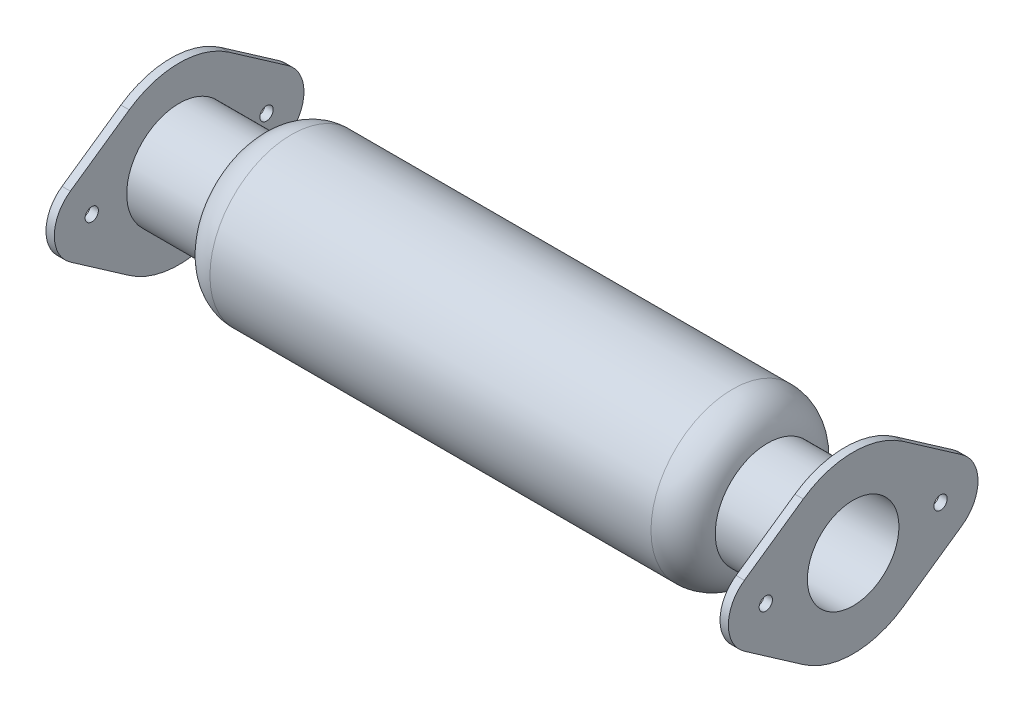
ISO-10303-21;
HEADER;
FILE_DESCRIPTION(('STEP AP214'),'2;1');
FILE_NAME('part.step','',(''),(''),'','','');
FILE_SCHEMA(('AUTOMOTIVE_DESIGN { 1 0 10303 214 1 1 1 1 }'));
ENDSEC;
DATA;
#1=APPLICATION_CONTEXT('core data for automotive mechanical design processes');
#2=APPLICATION_PROTOCOL_DEFINITION('international standard','automotive_design',2000,#1);
#3=PRODUCT_CONTEXT('',#1,'mechanical');
#4=PRODUCT('Part','Part','',(#3));
#5=PRODUCT_RELATED_PRODUCT_CATEGORY('part','',(#4));
#6=PRODUCT_DEFINITION_FORMATION('','',#4);
#7=PRODUCT_DEFINITION_CONTEXT('part definition',#1,'design');
#8=PRODUCT_DEFINITION('design','',#6,#7);
#9=PRODUCT_DEFINITION_SHAPE('','',#8);
#10=(LENGTH_UNIT() NAMED_UNIT(*) SI_UNIT(.MILLI.,.METRE.));
#11=(NAMED_UNIT(*) PLANE_ANGLE_UNIT() SI_UNIT($,.RADIAN.));
#12=(NAMED_UNIT(*) SI_UNIT($,.STERADIAN.) SOLID_ANGLE_UNIT());
#13=UNCERTAINTY_MEASURE_WITH_UNIT(LENGTH_MEASURE(1.E-05),#10,'distance_accuracy_value','');
#14=(GEOMETRIC_REPRESENTATION_CONTEXT(3) GLOBAL_UNCERTAINTY_ASSIGNED_CONTEXT((#13)) GLOBAL_UNIT_ASSIGNED_CONTEXT((#10,
#11,#12)) REPRESENTATION_CONTEXT('',''));
#15=CARTESIAN_POINT('',(0.,0.,0.));
#16=DIRECTION('',(0.,0.,1.));
#17=DIRECTION('',(1.,0.,0.));
#18=AXIS2_PLACEMENT_3D('',#15,#16,#17);
#19=CARTESIAN_POINT('',(0.,0.,0.));
#20=DIRECTION('',(1.,0.,0.));
#21=DIRECTION('',(0.,0.,-1.));
#22=AXIS2_PLACEMENT_3D('',#19,#20,#21);
#23=CYLINDRICAL_SURFACE('',#22,31.5);
#24=CARTESIAN_POINT('',(-200.,0.,0.));
#25=DIRECTION('',(1.,0.,0.));
#26=DIRECTION('',(0.,0.,-1.));
#27=AXIS2_PLACEMENT_3D('',#24,#25,#26);
#28=CIRCLE('',#27,31.5);
#29=CARTESIAN_POINT('',(-200.,0.,-31.5));
#30=VERTEX_POINT('',#29);
#31=EDGE_CURVE('E38',#30,#30,#28,.T.);
#32=ORIENTED_EDGE('',*,*,#31,.T.);
#33=EDGE_LOOP('',(#32));
#34=FACE_BOUND('',#33,.T.);
#35=CARTESIAN_POINT('',(-153.624630174278,0.,0.));
#36=DIRECTION('',(1.,0.,0.));
#37=DIRECTION('',(0.,0.,-1.));
#38=AXIS2_PLACEMENT_3D('',#35,#36,#37);
#39=CIRCLE('',#38,31.5);
#40=CARTESIAN_POINT('',(-153.624630174278,0.,-31.5));
#41=VERTEX_POINT('',#40);
#42=EDGE_CURVE('E11',#41,#41,#39,.T.);
#43=ORIENTED_EDGE('',*,*,#42,.F.);
#44=EDGE_LOOP('',(#43));
#45=FACE_BOUND('',#44,.T.);
#46=ADVANCED_FACE('F35',(#34,#45),#23,.T.);
#47=CARTESIAN_POINT('',(-132.5,0.,0.));
#48=DIRECTION('',(1.,0.,0.));
#49=DIRECTION('',(0.,0.,-1.));
#50=AXIS2_PLACEMENT_3D('',#47,#48,#49);
#51=TOROIDAL_SURFACE('',#50,27.5,21.5);
#52=ORIENTED_EDGE('',*,*,#42,.T.);
#53=EDGE_LOOP('',(#52));
#54=FACE_BOUND('',#53,.T.);
#55=CARTESIAN_POINT('',(-132.5,0.,0.));
#56=DIRECTION('',(1.,0.,0.));
#57=DIRECTION('',(0.,0.,-1.));
#58=AXIS2_PLACEMENT_3D('',#55,#56,#57);
#59=CIRCLE('',#58,49.);
#60=CARTESIAN_POINT('',(-132.5,0.,-49.));
#61=VERTEX_POINT('',#60);
#62=EDGE_CURVE('E44',#61,#61,#59,.T.);
#63=ORIENTED_EDGE('',*,*,#62,.F.);
#64=EDGE_LOOP('',(#63));
#65=FACE_BOUND('',#64,.T.);
#66=ADVANCED_FACE('F195',(#54,#65),#51,.T.);
#67=CARTESIAN_POINT('',(0.,0.,0.));
#68=DIRECTION('',(1.,0.,0.));
#69=DIRECTION('',(0.,0.,-1.));
#70=AXIS2_PLACEMENT_3D('',#67,#68,#69);
#71=CYLINDRICAL_SURFACE('',#70,49.);
#72=ORIENTED_EDGE('',*,*,#62,.T.);
#73=EDGE_LOOP('',(#72));
#74=FACE_BOUND('',#73,.T.);
#75=CARTESIAN_POINT('',(132.5,0.,0.));
#76=DIRECTION('',(1.,0.,0.));
#77=DIRECTION('',(0.,0.,-1.));
#78=AXIS2_PLACEMENT_3D('',#75,#76,#77);
#79=CIRCLE('',#78,49.);
#80=CARTESIAN_POINT('',(132.5,0.,-49.));
#81=VERTEX_POINT('',#80);
#82=EDGE_CURVE('E186',#81,#81,#79,.T.);
#83=ORIENTED_EDGE('',*,*,#82,.F.);
#84=EDGE_LOOP('',(#83));
#85=FACE_BOUND('',#84,.T.);
#86=ADVANCED_FACE('F192',(#74,#85),#71,.T.);
#87=CARTESIAN_POINT('',(132.5,0.,0.));
#88=DIRECTION('',(1.,0.,0.));
#89=DIRECTION('',(0.,0.,-1.));
#90=AXIS2_PLACEMENT_3D('',#87,#88,#89);
#91=TOROIDAL_SURFACE('',#90,27.5,21.5);
#92=ORIENTED_EDGE('',*,*,#82,.T.);
#93=EDGE_LOOP('',(#92));
#94=FACE_BOUND('',#93,.T.);
#95=CARTESIAN_POINT('',(153.624630174278,0.,0.));
#96=DIRECTION('',(1.,0.,0.));
#97=DIRECTION('',(0.,0.,-1.));
#98=AXIS2_PLACEMENT_3D('',#95,#96,#97);
#99=CIRCLE('',#98,31.5);
#100=CARTESIAN_POINT('',(153.624630174278,0.,-31.5));
#101=VERTEX_POINT('',#100);
#102=EDGE_CURVE('E183',#101,#101,#99,.T.);
#103=ORIENTED_EDGE('',*,*,#102,.F.);
#104=EDGE_LOOP('',(#103));
#105=FACE_BOUND('',#104,.T.);
#106=ADVANCED_FACE('F202',(#94,#105),#91,.T.);
#107=CARTESIAN_POINT('',(0.,0.,0.));
#108=DIRECTION('',(1.,0.,0.));
#109=DIRECTION('',(0.,0.,-1.));
#110=AXIS2_PLACEMENT_3D('',#107,#108,#109);
#111=CYLINDRICAL_SURFACE('',#110,31.5);
#112=ORIENTED_EDGE('',*,*,#102,.T.);
#113=EDGE_LOOP('',(#112));
#114=FACE_BOUND('',#113,.T.);
#115=CARTESIAN_POINT('',(200.,0.,0.));
#116=DIRECTION('',(1.,0.,0.));
#117=DIRECTION('',(0.,0.,-1.));
#118=AXIS2_PLACEMENT_3D('',#115,#116,#117);
#119=CIRCLE('',#118,31.5);
#120=CARTESIAN_POINT('',(200.,0.,-31.5));
#121=VERTEX_POINT('',#120);
#122=EDGE_CURVE('E180',#121,#121,#119,.T.);
#123=ORIENTED_EDGE('',*,*,#122,.F.);
#124=EDGE_LOOP('',(#123));
#125=FACE_BOUND('',#124,.T.);
#126=ADVANCED_FACE('F208',(#114,#125),#111,.T.);
#127=CARTESIAN_POINT('',(0.,0.,0.));
#128=DIRECTION('',(1.,0.,0.));
#129=DIRECTION('',(0.,0.,-1.));
#130=AXIS2_PLACEMENT_3D('',#127,#128,#129);
#131=CYLINDRICAL_SURFACE('',#130,27.5);
#132=CARTESIAN_POINT('',(150.,0.,0.));
#133=DIRECTION('',(1.,0.,0.));
#134=DIRECTION('',(0.,0.,-1.));
#135=AXIS2_PLACEMENT_3D('',#132,#133,#134);
#136=CIRCLE('',#135,27.5);
#137=CARTESIAN_POINT('',(150.,0.,-27.5));
#138=VERTEX_POINT('',#137);
#139=EDGE_CURVE('E177',#138,#138,#136,.T.);
#140=ORIENTED_EDGE('',*,*,#139,.F.);
#141=EDGE_LOOP('',(#140));
#142=FACE_BOUND('',#141,.T.);
#143=CARTESIAN_POINT('',(205.,0.,0.));
#144=DIRECTION('',(-1.,0.,0.));
#145=DIRECTION('',(0.,0.,1.));
#146=AXIS2_PLACEMENT_3D('',#143,#144,#145);
#147=CIRCLE('',#146,27.5);
#148=CARTESIAN_POINT('',(205.,0.,27.5));
#149=VERTEX_POINT('',#148);
#150=EDGE_CURVE('E331',#149,#149,#147,.T.);
#151=ORIENTED_EDGE('',*,*,#150,.F.);
#152=EDGE_LOOP('',(#151));
#153=FACE_BOUND('',#152,.T.);
#154=ADVANCED_FACE('F212',(#142,#153),#131,.F.);
#155=CARTESIAN_POINT('',(132.5,0.,0.));
#156=DIRECTION('',(1.,0.,0.));
#157=DIRECTION('',(0.,0.,-1.));
#158=AXIS2_PLACEMENT_3D('',#155,#156,#157);
#159=TOROIDAL_SURFACE('',#158,27.5,17.5);
#160=ORIENTED_EDGE('',*,*,#139,.T.);
#161=EDGE_LOOP('',(#160));
#162=FACE_BOUND('',#161,.T.);
#163=CARTESIAN_POINT('',(132.5,0.,0.));
#164=DIRECTION('',(1.,0.,0.));
#165=DIRECTION('',(0.,0.,-1.));
#166=AXIS2_PLACEMENT_3D('',#163,#164,#165);
#167=CIRCLE('',#166,45.);
#168=CARTESIAN_POINT('',(132.5,0.,-45.));
#169=VERTEX_POINT('',#168);
#170=EDGE_CURVE('E174',#169,#169,#167,.T.);
#171=ORIENTED_EDGE('',*,*,#170,.F.);
#172=EDGE_LOOP('',(#171));
#173=FACE_BOUND('',#172,.T.);
#174=ADVANCED_FACE('F216',(#162,#173),#159,.F.);
#175=CARTESIAN_POINT('',(0.,0.,0.));
#176=DIRECTION('',(1.,0.,0.));
#177=DIRECTION('',(0.,0.,-1.));
#178=AXIS2_PLACEMENT_3D('',#175,#176,#177);
#179=CYLINDRICAL_SURFACE('',#178,45.);
#180=ORIENTED_EDGE('',*,*,#170,.T.);
#181=EDGE_LOOP('',(#180));
#182=FACE_BOUND('',#181,.T.);
#183=CARTESIAN_POINT('',(-132.5,0.,0.));
#184=DIRECTION('',(1.,0.,0.));
#185=DIRECTION('',(0.,0.,-1.));
#186=AXIS2_PLACEMENT_3D('',#183,#184,#185);
#187=CIRCLE('',#186,45.);
#188=CARTESIAN_POINT('',(-132.5,0.,-45.));
#189=VERTEX_POINT('',#188);
#190=EDGE_CURVE('E171',#189,#189,#187,.T.);
#191=ORIENTED_EDGE('',*,*,#190,.F.);
#192=EDGE_LOOP('',(#191));
#193=FACE_BOUND('',#192,.T.);
#194=ADVANCED_FACE('F220',(#182,#193),#179,.F.);
#195=CARTESIAN_POINT('',(-132.5,0.,0.));
#196=DIRECTION('',(1.,0.,0.));
#197=DIRECTION('',(0.,0.,-1.));
#198=AXIS2_PLACEMENT_3D('',#195,#196,#197);
#199=TOROIDAL_SURFACE('',#198,27.5,17.5);
#200=ORIENTED_EDGE('',*,*,#190,.T.);
#201=EDGE_LOOP('',(#200));
#202=FACE_BOUND('',#201,.T.);
#203=CARTESIAN_POINT('',(-150.,0.,0.));
#204=DIRECTION('',(1.,0.,0.));
#205=DIRECTION('',(0.,0.,-1.));
#206=AXIS2_PLACEMENT_3D('',#203,#204,#205);
#207=CIRCLE('',#206,27.5);
#208=CARTESIAN_POINT('',(-150.,0.,-27.5));
#209=VERTEX_POINT('',#208);
#210=EDGE_CURVE('E168',#209,#209,#207,.T.);
#211=ORIENTED_EDGE('',*,*,#210,.F.);
#212=EDGE_LOOP('',(#211));
#213=FACE_BOUND('',#212,.T.);
#214=ADVANCED_FACE('F224',(#202,#213),#199,.F.);
#215=CARTESIAN_POINT('',(0.,0.,0.));
#216=DIRECTION('',(1.,0.,0.));
#217=DIRECTION('',(0.,0.,-1.));
#218=AXIS2_PLACEMENT_3D('',#215,#216,#217);
#219=CYLINDRICAL_SURFACE('',#218,27.5);
#220=ORIENTED_EDGE('',*,*,#210,.T.);
#221=EDGE_LOOP('',(#220));
#222=FACE_BOUND('',#221,.T.);
#223=CARTESIAN_POINT('',(-205.,0.,0.));
#224=DIRECTION('',(-1.,0.,0.));
#225=DIRECTION('',(0.,0.,1.));
#226=AXIS2_PLACEMENT_3D('',#223,#224,#225);
#227=CIRCLE('',#226,27.5);
#228=CARTESIAN_POINT('',(-205.,0.,27.5));
#229=VERTEX_POINT('',#228);
#230=EDGE_CURVE('E415',#229,#229,#227,.T.);
#231=ORIENTED_EDGE('',*,*,#230,.T.);
#232=EDGE_LOOP('',(#231));
#233=FACE_BOUND('',#232,.T.);
#234=ADVANCED_FACE('F228',(#222,#233),#219,.F.);
#235=CARTESIAN_POINT('',(-205.,0.,0.));
#236=DIRECTION('',(-1.,0.,0.));
#237=DIRECTION('',(0.,0.,1.));
#238=AXIS2_PLACEMENT_3D('',#235,#236,#237);
#239=PLANE('',#238);
#240=CARTESIAN_POINT('',(-205.,0.,52.5));
#241=DIRECTION('',(-1.,0.,0.));
#242=DIRECTION('',(0.,0.,1.));
#243=AXIS2_PLACEMENT_3D('',#240,#241,#242);
#244=CIRCLE('',#243,4.);
#245=CARTESIAN_POINT('',(-205.,0.,56.5));
#246=VERTEX_POINT('',#245);
#247=EDGE_CURVE('E419',#246,#246,#244,.T.);
#248=ORIENTED_EDGE('',*,*,#247,.F.);
#249=EDGE_LOOP('',(#248));
#250=FACE_BOUND('',#249,.T.);
#251=CARTESIAN_POINT('',(-205.,0.,0.));
#252=DIRECTION('',(-1.,0.,0.));
#253=DIRECTION('',(0.,0.,1.));
#254=AXIS2_PLACEMENT_3D('',#251,#252,#253);
#255=CIRCLE('',#254,52.5);
#256=CARTESIAN_POINT('',(-205.,43.0842198490352,30.));
#257=VERTEX_POINT('',#256);
#258=CARTESIAN_POINT('',(-205.,43.0842198490352,-30.));
#259=VERTEX_POINT('',#258);
#260=EDGE_CURVE('E153',#257,#259,#255,.T.);
#261=ORIENTED_EDGE('',*,*,#260,.T.);
#262=DIRECTION('',(0.,-0.571428571428571,-0.82065180664829));
#263=VECTOR('',#262,1.);
#264=CARTESIAN_POINT('',(-205.,43.0842198490352,-30.));
#265=LINE('',#264,#263);
#266=CARTESIAN_POINT('',(-205.,18.4646656495865,-65.3571428571428));
#267=VERTEX_POINT('',#266);
#268=EDGE_CURVE('E97',#259,#267,#265,.T.);
#269=ORIENTED_EDGE('',*,*,#268,.T.);
#270=CARTESIAN_POINT('',(-205.,0.,-52.5));
#271=DIRECTION('',(-1.,0.,0.));
#272=DIRECTION('',(0.,0.,1.));
#273=AXIS2_PLACEMENT_3D('',#270,#271,#272);
#274=CIRCLE('',#273,22.5);
#275=CARTESIAN_POINT('',(-205.,-18.4646656495865,-65.3571428571428));
#276=VERTEX_POINT('',#275);
#277=EDGE_CURVE('E431',#267,#276,#274,.T.);
#278=ORIENTED_EDGE('',*,*,#277,.T.);
#279=DIRECTION('',(0.,-0.571428571428572,0.82065180664829));
#280=VECTOR('',#279,1.);
#281=CARTESIAN_POINT('',(-205.,-18.4646656495865,-65.3571428571428));
#282=LINE('',#281,#280);
#283=CARTESIAN_POINT('',(-205.,-43.0842198490352,-30.));
#284=VERTEX_POINT('',#283);
#285=EDGE_CURVE('E433',#276,#284,#282,.T.);
#286=ORIENTED_EDGE('',*,*,#285,.T.);
#287=CARTESIAN_POINT('',(-205.,0.,0.));
#288=DIRECTION('',(-1.,0.,0.));
#289=DIRECTION('',(0.,0.,1.));
#290=AXIS2_PLACEMENT_3D('',#287,#288,#289);
#291=CIRCLE('',#290,52.5);
#292=CARTESIAN_POINT('',(-205.,-43.0842198490352,30.));
#293=VERTEX_POINT('',#292);
#294=EDGE_CURVE('E120',#284,#293,#291,.T.);
#295=ORIENTED_EDGE('',*,*,#294,.T.);
#296=DIRECTION('',(0.,0.571428571428571,0.82065180664829));
#297=VECTOR('',#296,1.);
#298=CARTESIAN_POINT('',(-205.,-18.4646656495865,65.3571428571429));
#299=LINE('',#298,#297);
#300=CARTESIAN_POINT('',(-205.,-18.4646656495865,65.3571428571429));
#301=VERTEX_POINT('',#300);
#302=EDGE_CURVE('E113',#293,#301,#299,.T.);
#303=ORIENTED_EDGE('',*,*,#302,.T.);
#304=CARTESIAN_POINT('',(-205.,0.,52.5));
#305=DIRECTION('',(-1.,0.,0.));
#306=DIRECTION('',(0.,0.,1.));
#307=AXIS2_PLACEMENT_3D('',#304,#305,#306);
#308=CIRCLE('',#307,22.5);
#309=CARTESIAN_POINT('',(-205.,18.4646656495865,65.3571428571428));
#310=VERTEX_POINT('',#309);
#311=EDGE_CURVE('E118',#301,#310,#308,.T.);
#312=ORIENTED_EDGE('',*,*,#311,.T.);
#313=DIRECTION('',(0.,0.571428571428571,-0.82065180664829));
#314=VECTOR('',#313,1.);
#315=CARTESIAN_POINT('',(-205.,18.4646656495865,65.3571428571428));
#316=LINE('',#315,#314);
#317=EDGE_CURVE('E52',#310,#257,#316,.T.);
#318=ORIENTED_EDGE('',*,*,#317,.T.);
#319=EDGE_LOOP('',(#261,#269,#278,#286,#295,#303,#312,#318));
#320=FACE_BOUND('',#319,.T.);
#321=CARTESIAN_POINT('',(-205.,0.,-52.5));
#322=DIRECTION('',(-1.,0.,0.));
#323=DIRECTION('',(0.,0.,1.));
#324=AXIS2_PLACEMENT_3D('',#321,#322,#323);
#325=CIRCLE('',#324,4.);
#326=CARTESIAN_POINT('',(-205.,0.,-48.5));
#327=VERTEX_POINT('',#326);
#328=EDGE_CURVE('E142',#327,#327,#325,.T.);
#329=ORIENTED_EDGE('',*,*,#328,.F.);
#330=EDGE_LOOP('',(#329));
#331=FACE_BOUND('',#330,.T.);
#332=ORIENTED_EDGE('',*,*,#230,.F.);
#333=EDGE_LOOP('',(#332));
#334=FACE_BOUND('',#333,.T.);
#335=ADVANCED_FACE('F115',(#250,#320,#331,#334),#239,.T.);
#336=CARTESIAN_POINT('',(-200.,0.,0.));
#337=DIRECTION('',(-1.,0.,0.));
#338=DIRECTION('',(0.,0.,1.));
#339=AXIS2_PLACEMENT_3D('',#336,#337,#338);
#340=PLANE('',#339);
#341=ORIENTED_EDGE('',*,*,#31,.F.);
#342=EDGE_LOOP('',(#341));
#343=FACE_BOUND('',#342,.T.);
#344=CARTESIAN_POINT('',(-200.,0.,0.));
#345=DIRECTION('',(-1.,0.,0.));
#346=DIRECTION('',(0.,0.,1.));
#347=AXIS2_PLACEMENT_3D('',#344,#345,#346);
#348=CIRCLE('',#347,52.5);
#349=CARTESIAN_POINT('',(-200.,43.0842198490352,30.));
#350=VERTEX_POINT('',#349);
#351=CARTESIAN_POINT('',(-200.,43.0842198490352,-30.));
#352=VERTEX_POINT('',#351);
#353=EDGE_CURVE('E138',#350,#352,#348,.T.);
#354=ORIENTED_EDGE('',*,*,#353,.F.);
#355=DIRECTION('',(0.,0.571428571428571,-0.82065180664829));
#356=VECTOR('',#355,1.);
#357=CARTESIAN_POINT('',(-200.,18.4646656495865,65.3571428571428));
#358=LINE('',#357,#356);
#359=CARTESIAN_POINT('',(-200.,18.4646656495865,65.3571428571428));
#360=VERTEX_POINT('',#359);
#361=EDGE_CURVE('E88',#360,#350,#358,.T.);
#362=ORIENTED_EDGE('',*,*,#361,.F.);
#363=CARTESIAN_POINT('',(-200.,0.,52.5));
#364=DIRECTION('',(-1.,0.,0.));
#365=DIRECTION('',(0.,0.,1.));
#366=AXIS2_PLACEMENT_3D('',#363,#364,#365);
#367=CIRCLE('',#366,22.5);
#368=CARTESIAN_POINT('',(-200.,-18.4646656495865,65.3571428571429));
#369=VERTEX_POINT('',#368);
#370=EDGE_CURVE('E82',#369,#360,#367,.T.);
#371=ORIENTED_EDGE('',*,*,#370,.F.);
#372=DIRECTION('',(0.,0.571428571428571,0.82065180664829));
#373=VECTOR('',#372,1.);
#374=CARTESIAN_POINT('',(-200.,-18.4646656495865,65.3571428571429));
#375=LINE('',#374,#373);
#376=CARTESIAN_POINT('',(-200.,-43.0842198490352,30.));
#377=VERTEX_POINT('',#376);
#378=EDGE_CURVE('E128',#377,#369,#375,.T.);
#379=ORIENTED_EDGE('',*,*,#378,.F.);
#380=CARTESIAN_POINT('',(-200.,0.,0.));
#381=DIRECTION('',(-1.,0.,0.));
#382=DIRECTION('',(0.,0.,1.));
#383=AXIS2_PLACEMENT_3D('',#380,#381,#382);
#384=CIRCLE('',#383,52.5);
#385=CARTESIAN_POINT('',(-200.,-43.0842198490352,-30.));
#386=VERTEX_POINT('',#385);
#387=EDGE_CURVE('E148',#386,#377,#384,.T.);
#388=ORIENTED_EDGE('',*,*,#387,.F.);
#389=DIRECTION('',(0.,-0.571428571428572,0.82065180664829));
#390=VECTOR('',#389,1.);
#391=CARTESIAN_POINT('',(-200.,-18.4646656495865,-65.3571428571428));
#392=LINE('',#391,#390);
#393=CARTESIAN_POINT('',(-200.,-18.4646656495865,-65.3571428571428));
#394=VERTEX_POINT('',#393);
#395=EDGE_CURVE('E146',#394,#386,#392,.T.);
#396=ORIENTED_EDGE('',*,*,#395,.F.);
#397=CARTESIAN_POINT('',(-200.,0.,-52.5));
#398=DIRECTION('',(-1.,0.,0.));
#399=DIRECTION('',(0.,0.,1.));
#400=AXIS2_PLACEMENT_3D('',#397,#398,#399);
#401=CIRCLE('',#400,22.5);
#402=CARTESIAN_POINT('',(-200.,18.4646656495865,-65.3571428571428));
#403=VERTEX_POINT('',#402);
#404=EDGE_CURVE('E144',#403,#394,#401,.T.);
#405=ORIENTED_EDGE('',*,*,#404,.F.);
#406=DIRECTION('',(0.,-0.571428571428571,-0.82065180664829));
#407=VECTOR('',#406,1.);
#408=CARTESIAN_POINT('',(-200.,43.0842198490352,-30.));
#409=LINE('',#408,#407);
#410=EDGE_CURVE('E141',#352,#403,#409,.T.);
#411=ORIENTED_EDGE('',*,*,#410,.F.);
#412=EDGE_LOOP('',(#354,#362,#371,#379,#388,#396,#405,#411));
#413=FACE_BOUND('',#412,.T.);
#414=CARTESIAN_POINT('',(-200.,0.,-52.5));
#415=DIRECTION('',(-1.,0.,0.));
#416=DIRECTION('',(0.,0.,1.));
#417=AXIS2_PLACEMENT_3D('',#414,#415,#416);
#418=CIRCLE('',#417,4.);
#419=CARTESIAN_POINT('',(-200.,0.,-48.5));
#420=VERTEX_POINT('',#419);
#421=EDGE_CURVE('E422',#420,#420,#418,.T.);
#422=ORIENTED_EDGE('',*,*,#421,.T.);
#423=EDGE_LOOP('',(#422));
#424=FACE_BOUND('',#423,.T.);
#425=CARTESIAN_POINT('',(-200.,0.,52.5));
#426=DIRECTION('',(-1.,0.,0.));
#427=DIRECTION('',(0.,0.,1.));
#428=AXIS2_PLACEMENT_3D('',#425,#426,#427);
#429=CIRCLE('',#428,4.);
#430=CARTESIAN_POINT('',(-200.,0.,56.5));
#431=VERTEX_POINT('',#430);
#432=EDGE_CURVE('E418',#431,#431,#429,.T.);
#433=ORIENTED_EDGE('',*,*,#432,.T.);
#434=EDGE_LOOP('',(#433));
#435=FACE_BOUND('',#434,.T.);
#436=ADVANCED_FACE('F237',(#343,#413,#424,#435),#340,.F.);
#437=CARTESIAN_POINT('',(-205.,0.,0.));
#438=DIRECTION('',(1.,0.,0.));
#439=DIRECTION('',(0.,0.,-1.));
#440=AXIS2_PLACEMENT_3D('',#437,#438,#439);
#441=CYLINDRICAL_SURFACE('',#440,52.5);
#442=ORIENTED_EDGE('',*,*,#353,.T.);
#443=DIRECTION('',(1.,0.,0.));
#444=VECTOR('',#443,1.);
#445=CARTESIAN_POINT('',(-205.,43.0842198490352,-30.));
#446=LINE('',#445,#444);
#447=EDGE_CURVE('E166',#259,#352,#446,.T.);
#448=ORIENTED_EDGE('',*,*,#447,.F.);
#449=ORIENTED_EDGE('',*,*,#260,.F.);
#450=DIRECTION('',(1.,0.,0.));
#451=VECTOR('',#450,1.);
#452=CARTESIAN_POINT('',(-205.,43.0842198490352,30.));
#453=LINE('',#452,#451);
#454=EDGE_CURVE('E134',#257,#350,#453,.T.);
#455=ORIENTED_EDGE('',*,*,#454,.T.);
#456=EDGE_LOOP('',(#442,#448,#449,#455));
#457=FACE_BOUND('',#456,.T.);
#458=ADVANCED_FACE('F233',(#457),#441,.T.);
#459=CARTESIAN_POINT('',(-205.,43.0842198490352,-30.));
#460=DIRECTION('',(0.,-0.82065180664829,0.571428571428571));
#461=DIRECTION('',(0.,-0.571428571428571,-0.82065180664829));
#462=AXIS2_PLACEMENT_3D('',#459,#460,#461);
#463=PLANE('',#462);
#464=ORIENTED_EDGE('',*,*,#410,.T.);
#465=DIRECTION('',(1.,0.,0.));
#466=VECTOR('',#465,1.);
#467=CARTESIAN_POINT('',(-205.,18.4646656495865,-65.3571428571428));
#468=LINE('',#467,#466);
#469=EDGE_CURVE('E163',#267,#403,#468,.T.);
#470=ORIENTED_EDGE('',*,*,#469,.F.);
#471=ORIENTED_EDGE('',*,*,#268,.F.);
#472=ORIENTED_EDGE('',*,*,#447,.T.);
#473=EDGE_LOOP('',(#464,#470,#471,#472));
#474=FACE_BOUND('',#473,.T.);
#475=ADVANCED_FACE('F236',(#474),#463,.F.);
#476=CARTESIAN_POINT('',(-205.,0.,-52.5));
#477=DIRECTION('',(1.,0.,0.));
#478=DIRECTION('',(0.,0.,-1.));
#479=AXIS2_PLACEMENT_3D('',#476,#477,#478);
#480=CYLINDRICAL_SURFACE('',#479,22.5);
#481=ORIENTED_EDGE('',*,*,#404,.T.);
#482=DIRECTION('',(1.,0.,0.));
#483=VECTOR('',#482,1.);
#484=CARTESIAN_POINT('',(-205.,-18.4646656495865,-65.3571428571428));
#485=LINE('',#484,#483);
#486=EDGE_CURVE('E160',#276,#394,#485,.T.);
#487=ORIENTED_EDGE('',*,*,#486,.F.);
#488=ORIENTED_EDGE('',*,*,#277,.F.);
#489=ORIENTED_EDGE('',*,*,#469,.T.);
#490=EDGE_LOOP('',(#481,#487,#488,#489));
#491=FACE_BOUND('',#490,.T.);
#492=ADVANCED_FACE('F241',(#491),#480,.T.);
#493=CARTESIAN_POINT('',(-205.,-18.4646656495865,-65.3571428571428));
#494=DIRECTION('',(0.,0.82065180664829,0.571428571428572));
#495=DIRECTION('',(0.,-0.571428571428572,0.82065180664829));
#496=AXIS2_PLACEMENT_3D('',#493,#494,#495);
#497=PLANE('',#496);
#498=ORIENTED_EDGE('',*,*,#395,.T.);
#499=DIRECTION('',(1.,0.,0.));
#500=VECTOR('',#499,1.);
#501=CARTESIAN_POINT('',(-205.,-43.0842198490352,-30.));
#502=LINE('',#501,#500);
#503=EDGE_CURVE('E157',#284,#386,#502,.T.);
#504=ORIENTED_EDGE('',*,*,#503,.F.);
#505=ORIENTED_EDGE('',*,*,#285,.F.);
#506=ORIENTED_EDGE('',*,*,#486,.T.);
#507=EDGE_LOOP('',(#498,#504,#505,#506));
#508=FACE_BOUND('',#507,.T.);
#509=ADVANCED_FACE('F244',(#508),#497,.F.);
#510=CARTESIAN_POINT('',(-205.,0.,0.));
#511=DIRECTION('',(1.,0.,0.));
#512=DIRECTION('',(0.,0.,-1.));
#513=AXIS2_PLACEMENT_3D('',#510,#511,#512);
#514=CYLINDRICAL_SURFACE('',#513,52.5);
#515=ORIENTED_EDGE('',*,*,#387,.T.);
#516=DIRECTION('',(1.,0.,0.));
#517=VECTOR('',#516,1.);
#518=CARTESIAN_POINT('',(-205.,-43.0842198490352,30.));
#519=LINE('',#518,#517);
#520=EDGE_CURVE('E129',#293,#377,#519,.T.);
#521=ORIENTED_EDGE('',*,*,#520,.F.);
#522=ORIENTED_EDGE('',*,*,#294,.F.);
#523=ORIENTED_EDGE('',*,*,#503,.T.);
#524=EDGE_LOOP('',(#515,#521,#522,#523));
#525=FACE_BOUND('',#524,.T.);
#526=ADVANCED_FACE('F248',(#525),#514,.T.);
#527=CARTESIAN_POINT('',(-205.,-18.4646656495865,65.3571428571429));
#528=DIRECTION('',(0.,0.82065180664829,-0.571428571428571));
#529=DIRECTION('',(0.,0.571428571428571,0.82065180664829));
#530=AXIS2_PLACEMENT_3D('',#527,#528,#529);
#531=PLANE('',#530);
#532=ORIENTED_EDGE('',*,*,#378,.T.);
#533=DIRECTION('',(1.,0.,0.));
#534=VECTOR('',#533,1.);
#535=CARTESIAN_POINT('',(-205.,-18.4646656495865,65.3571428571429));
#536=LINE('',#535,#534);
#537=EDGE_CURVE('E125',#301,#369,#536,.T.);
#538=ORIENTED_EDGE('',*,*,#537,.F.);
#539=ORIENTED_EDGE('',*,*,#302,.F.);
#540=ORIENTED_EDGE('',*,*,#520,.T.);
#541=EDGE_LOOP('',(#532,#538,#539,#540));
#542=FACE_BOUND('',#541,.T.);
#543=ADVANCED_FACE('F126',(#542),#531,.F.);
#544=CARTESIAN_POINT('',(-205.,0.,52.5));
#545=DIRECTION('',(1.,0.,0.));
#546=DIRECTION('',(0.,0.,-1.));
#547=AXIS2_PLACEMENT_3D('',#544,#545,#546);
#548=CYLINDRICAL_SURFACE('',#547,22.5);
#549=ORIENTED_EDGE('',*,*,#370,.T.);
#550=DIRECTION('',(1.,0.,0.));
#551=VECTOR('',#550,1.);
#552=CARTESIAN_POINT('',(-205.,18.4646656495865,65.3571428571428));
#553=LINE('',#552,#551);
#554=EDGE_CURVE('E130',#310,#360,#553,.T.);
#555=ORIENTED_EDGE('',*,*,#554,.F.);
#556=ORIENTED_EDGE('',*,*,#311,.F.);
#557=ORIENTED_EDGE('',*,*,#537,.T.);
#558=EDGE_LOOP('',(#549,#555,#556,#557));
#559=FACE_BOUND('',#558,.T.);
#560=ADVANCED_FACE('F132',(#559),#548,.T.);
#561=CARTESIAN_POINT('',(-205.,18.4646656495865,65.3571428571428));
#562=DIRECTION('',(0.,-0.82065180664829,-0.571428571428571));
#563=DIRECTION('',(0.,0.571428571428571,-0.82065180664829));
#564=AXIS2_PLACEMENT_3D('',#561,#562,#563);
#565=PLANE('',#564);
#566=ORIENTED_EDGE('',*,*,#361,.T.);
#567=ORIENTED_EDGE('',*,*,#454,.F.);
#568=ORIENTED_EDGE('',*,*,#317,.F.);
#569=ORIENTED_EDGE('',*,*,#554,.T.);
#570=EDGE_LOOP('',(#566,#567,#568,#569));
#571=FACE_BOUND('',#570,.T.);
#572=ADVANCED_FACE('F257',(#571),#565,.F.);
#573=CARTESIAN_POINT('',(-205.,0.,-52.5));
#574=DIRECTION('',(1.,0.,0.));
#575=DIRECTION('',(0.,0.,-1.));
#576=AXIS2_PLACEMENT_3D('',#573,#574,#575);
#577=CYLINDRICAL_SURFACE('',#576,4.);
#578=ORIENTED_EDGE('',*,*,#328,.T.);
#579=EDGE_LOOP('',(#578));
#580=FACE_BOUND('',#579,.T.);
#581=ORIENTED_EDGE('',*,*,#421,.F.);
#582=EDGE_LOOP('',(#581));
#583=FACE_BOUND('',#582,.T.);
#584=ADVANCED_FACE('F260',(#580,#583),#577,.F.);
#585=CARTESIAN_POINT('',(-205.,0.,52.5));
#586=DIRECTION('',(1.,0.,0.));
#587=DIRECTION('',(0.,0.,-1.));
#588=AXIS2_PLACEMENT_3D('',#585,#586,#587);
#589=CYLINDRICAL_SURFACE('',#588,4.);
#590=ORIENTED_EDGE('',*,*,#247,.T.);
#591=EDGE_LOOP('',(#590));
#592=FACE_BOUND('',#591,.T.);
#593=ORIENTED_EDGE('',*,*,#432,.F.);
#594=EDGE_LOOP('',(#593));
#595=FACE_BOUND('',#594,.T.);
#596=ADVANCED_FACE('F269',(#592,#595),#589,.F.);
#597=CARTESIAN_POINT('',(205.,0.,0.));
#598=DIRECTION('',(-1.,0.,0.));
#599=DIRECTION('',(0.,0.,1.));
#600=AXIS2_PLACEMENT_3D('',#597,#598,#599);
#601=CYLINDRICAL_SURFACE('',#600,52.5);
#602=CARTESIAN_POINT('',(200.,0.,0.));
#603=DIRECTION('',(-1.,0.,0.));
#604=DIRECTION('',(0.,0.,1.));
#605=AXIS2_PLACEMENT_3D('',#602,#603,#604);
#606=CIRCLE('',#605,52.5);
#607=CARTESIAN_POINT('',(200.,43.0842198490352,30.));
#608=VERTEX_POINT('',#607);
#609=CARTESIAN_POINT('',(200.,43.0842198490352,-30.));
#610=VERTEX_POINT('',#609);
#611=EDGE_CURVE('E341',#608,#610,#606,.T.);
#612=ORIENTED_EDGE('',*,*,#611,.F.);
#613=DIRECTION('',(-1.,0.,0.));
#614=VECTOR('',#613,1.);
#615=CARTESIAN_POINT('',(205.,43.0842198490352,30.));
#616=LINE('',#615,#614);
#617=CARTESIAN_POINT('',(205.,43.0842198490352,30.));
#618=VERTEX_POINT('',#617);
#619=EDGE_CURVE('E412',#618,#608,#616,.T.);
#620=ORIENTED_EDGE('',*,*,#619,.F.);
#621=CARTESIAN_POINT('',(205.,0.,0.));
#622=DIRECTION('',(-1.,0.,0.));
#623=DIRECTION('',(0.,0.,1.));
#624=AXIS2_PLACEMENT_3D('',#621,#622,#623);
#625=CIRCLE('',#624,52.5);
#626=CARTESIAN_POINT('',(205.,43.0842198490352,-30.));
#627=VERTEX_POINT('',#626);
#628=EDGE_CURVE('E344',#618,#627,#625,.T.);
#629=ORIENTED_EDGE('',*,*,#628,.T.);
#630=DIRECTION('',(-1.,0.,0.));
#631=VECTOR('',#630,1.);
#632=CARTESIAN_POINT('',(205.,43.0842198490352,-30.));
#633=LINE('',#632,#631);
#634=EDGE_CURVE('E369',#627,#610,#633,.T.);
#635=ORIENTED_EDGE('',*,*,#634,.T.);
#636=EDGE_LOOP('',(#612,#620,#629,#635));
#637=FACE_BOUND('',#636,.T.);
#638=ADVANCED_FACE('F273',(#637),#601,.T.);
#639=CARTESIAN_POINT('',(205.,18.4646656495865,65.3571428571428));
#640=DIRECTION('',(0.,0.82065180664829,0.571428571428571));
#641=DIRECTION('',(0.,-0.571428571428571,0.82065180664829));
#642=AXIS2_PLACEMENT_3D('',#639,#640,#641);
#643=PLANE('',#642);
#644=DIRECTION('',(0.,0.571428571428571,-0.82065180664829));
#645=VECTOR('',#644,1.);
#646=CARTESIAN_POINT('',(200.,18.4646656495865,65.3571428571428));
#647=LINE('',#646,#645);
#648=CARTESIAN_POINT('',(200.,18.4646656495865,65.3571428571428));
#649=VERTEX_POINT('',#648);
#650=EDGE_CURVE('E372',#649,#608,#647,.T.);
#651=ORIENTED_EDGE('',*,*,#650,.F.);
#652=DIRECTION('',(-1.,0.,0.));
#653=VECTOR('',#652,1.);
#654=CARTESIAN_POINT('',(205.,18.4646656495865,65.3571428571428));
#655=LINE('',#654,#653);
#656=CARTESIAN_POINT('',(205.,18.4646656495865,65.3571428571428));
#657=VERTEX_POINT('',#656);
#658=EDGE_CURVE('E409',#657,#649,#655,.T.);
#659=ORIENTED_EDGE('',*,*,#658,.F.);
#660=DIRECTION('',(0.,0.571428571428571,-0.82065180664829));
#661=VECTOR('',#660,1.);
#662=CARTESIAN_POINT('',(205.,18.4646656495865,65.3571428571428));
#663=LINE('',#662,#661);
#664=EDGE_CURVE('E347',#657,#618,#663,.T.);
#665=ORIENTED_EDGE('',*,*,#664,.T.);
#666=ORIENTED_EDGE('',*,*,#619,.T.);
#667=EDGE_LOOP('',(#651,#659,#665,#666));
#668=FACE_BOUND('',#667,.T.);
#669=ADVANCED_FACE('F277',(#668),#643,.T.);
#670=CARTESIAN_POINT('',(205.,0.,52.5));
#671=DIRECTION('',(-1.,0.,0.));
#672=DIRECTION('',(0.,0.,1.));
#673=AXIS2_PLACEMENT_3D('',#670,#671,#672);
#674=CYLINDRICAL_SURFACE('',#673,22.5);
#675=CARTESIAN_POINT('',(200.,0.,52.5));
#676=DIRECTION('',(-1.,0.,0.));
#677=DIRECTION('',(0.,0.,1.));
#678=AXIS2_PLACEMENT_3D('',#675,#676,#677);
#679=CIRCLE('',#678,22.5);
#680=CARTESIAN_POINT('',(200.,-18.4646656495865,65.3571428571429));
#681=VERTEX_POINT('',#680);
#682=EDGE_CURVE('E375',#681,#649,#679,.T.);
#683=ORIENTED_EDGE('',*,*,#682,.F.);
#684=DIRECTION('',(-1.,0.,0.));
#685=VECTOR('',#684,1.);
#686=CARTESIAN_POINT('',(205.,-18.4646656495865,65.3571428571429));
#687=LINE('',#686,#685);
#688=CARTESIAN_POINT('',(205.,-18.4646656495865,65.3571428571429));
#689=VERTEX_POINT('',#688);
#690=EDGE_CURVE('E406',#689,#681,#687,.T.);
#691=ORIENTED_EDGE('',*,*,#690,.F.);
#692=CARTESIAN_POINT('',(205.,0.,52.5));
#693=DIRECTION('',(-1.,0.,0.));
#694=DIRECTION('',(0.,0.,1.));
#695=AXIS2_PLACEMENT_3D('',#692,#693,#694);
#696=CIRCLE('',#695,22.5);
#697=EDGE_CURVE('E351',#689,#657,#696,.T.);
#698=ORIENTED_EDGE('',*,*,#697,.T.);
#699=ORIENTED_EDGE('',*,*,#658,.T.);
#700=EDGE_LOOP('',(#683,#691,#698,#699));
#701=FACE_BOUND('',#700,.T.);
#702=ADVANCED_FACE('F281',(#701),#674,.T.);
#703=CARTESIAN_POINT('',(205.,-18.4646656495865,65.3571428571429));
#704=DIRECTION('',(0.,-0.82065180664829,0.571428571428571));
#705=DIRECTION('',(0.,-0.571428571428571,-0.82065180664829));
#706=AXIS2_PLACEMENT_3D('',#703,#704,#705);
#707=PLANE('',#706);
#708=DIRECTION('',(0.,0.571428571428571,0.82065180664829));
#709=VECTOR('',#708,1.);
#710=CARTESIAN_POINT('',(200.,-18.4646656495865,65.3571428571429));
#711=LINE('',#710,#709);
#712=CARTESIAN_POINT('',(200.,-43.0842198490352,30.));
#713=VERTEX_POINT('',#712);
#714=EDGE_CURVE('E378',#713,#681,#711,.T.);
#715=ORIENTED_EDGE('',*,*,#714,.F.);
#716=DIRECTION('',(-1.,0.,0.));
#717=VECTOR('',#716,1.);
#718=CARTESIAN_POINT('',(205.,-43.0842198490352,30.));
#719=LINE('',#718,#717);
#720=CARTESIAN_POINT('',(205.,-43.0842198490352,30.));
#721=VERTEX_POINT('',#720);
#722=EDGE_CURVE('E403',#721,#713,#719,.T.);
#723=ORIENTED_EDGE('',*,*,#722,.F.);
#724=DIRECTION('',(0.,0.571428571428571,0.82065180664829));
#725=VECTOR('',#724,1.);
#726=CARTESIAN_POINT('',(205.,-18.4646656495865,65.3571428571429));
#727=LINE('',#726,#725);
#728=EDGE_CURVE('E354',#721,#689,#727,.T.);
#729=ORIENTED_EDGE('',*,*,#728,.T.);
#730=ORIENTED_EDGE('',*,*,#690,.T.);
#731=EDGE_LOOP('',(#715,#723,#729,#730));
#732=FACE_BOUND('',#731,.T.);
#733=ADVANCED_FACE('F285',(#732),#707,.T.);
#734=CARTESIAN_POINT('',(205.,0.,0.));
#735=DIRECTION('',(-1.,0.,0.));
#736=DIRECTION('',(0.,0.,1.));
#737=AXIS2_PLACEMENT_3D('',#734,#735,#736);
#738=CYLINDRICAL_SURFACE('',#737,52.5);
#739=CARTESIAN_POINT('',(200.,0.,0.));
#740=DIRECTION('',(-1.,0.,0.));
#741=DIRECTION('',(0.,0.,1.));
#742=AXIS2_PLACEMENT_3D('',#739,#740,#741);
#743=CIRCLE('',#742,52.5);
#744=CARTESIAN_POINT('',(200.,-43.0842198490352,-30.));
#745=VERTEX_POINT('',#744);
#746=EDGE_CURVE('E381',#745,#713,#743,.T.);
#747=ORIENTED_EDGE('',*,*,#746,.F.);
#748=DIRECTION('',(-1.,0.,0.));
#749=VECTOR('',#748,1.);
#750=CARTESIAN_POINT('',(205.,-43.0842198490352,-30.));
#751=LINE('',#750,#749);
#752=CARTESIAN_POINT('',(205.,-43.0842198490352,-30.));
#753=VERTEX_POINT('',#752);
#754=EDGE_CURVE('E400',#753,#745,#751,.T.);
#755=ORIENTED_EDGE('',*,*,#754,.F.);
#756=CARTESIAN_POINT('',(205.,0.,0.));
#757=DIRECTION('',(-1.,0.,0.));
#758=DIRECTION('',(0.,0.,1.));
#759=AXIS2_PLACEMENT_3D('',#756,#757,#758);
#760=CIRCLE('',#759,52.5);
#761=EDGE_CURVE('E357',#753,#721,#760,.T.);
#762=ORIENTED_EDGE('',*,*,#761,.T.);
#763=ORIENTED_EDGE('',*,*,#722,.T.);
#764=EDGE_LOOP('',(#747,#755,#762,#763));
#765=FACE_BOUND('',#764,.T.);
#766=ADVANCED_FACE('F289',(#765),#738,.T.);
#767=CARTESIAN_POINT('',(205.,-18.4646656495865,-65.3571428571428));
#768=DIRECTION('',(0.,-0.82065180664829,-0.571428571428572));
#769=DIRECTION('',(0.,0.571428571428572,-0.82065180664829));
#770=AXIS2_PLACEMENT_3D('',#767,#768,#769);
#771=PLANE('',#770);
#772=DIRECTION('',(0.,-0.571428571428572,0.82065180664829));
#773=VECTOR('',#772,1.);
#774=CARTESIAN_POINT('',(200.,-18.4646656495865,-65.3571428571428));
#775=LINE('',#774,#773);
#776=CARTESIAN_POINT('',(200.,-18.4646656495865,-65.3571428571428));
#777=VERTEX_POINT('',#776);
#778=EDGE_CURVE('E384',#777,#745,#775,.T.);
#779=ORIENTED_EDGE('',*,*,#778,.F.);
#780=DIRECTION('',(-1.,0.,0.));
#781=VECTOR('',#780,1.);
#782=CARTESIAN_POINT('',(205.,-18.4646656495865,-65.3571428571428));
#783=LINE('',#782,#781);
#784=CARTESIAN_POINT('',(205.,-18.4646656495865,-65.3571428571428));
#785=VERTEX_POINT('',#784);
#786=EDGE_CURVE('E397',#785,#777,#783,.T.);
#787=ORIENTED_EDGE('',*,*,#786,.F.);
#788=DIRECTION('',(0.,-0.571428571428572,0.82065180664829));
#789=VECTOR('',#788,1.);
#790=CARTESIAN_POINT('',(205.,-18.4646656495865,-65.3571428571428));
#791=LINE('',#790,#789);
#792=EDGE_CURVE('E360',#785,#753,#791,.T.);
#793=ORIENTED_EDGE('',*,*,#792,.T.);
#794=ORIENTED_EDGE('',*,*,#754,.T.);
#795=EDGE_LOOP('',(#779,#787,#793,#794));
#796=FACE_BOUND('',#795,.T.);
#797=ADVANCED_FACE('F293',(#796),#771,.T.);
#798=CARTESIAN_POINT('',(205.,0.,-52.5));
#799=DIRECTION('',(-1.,0.,0.));
#800=DIRECTION('',(0.,0.,1.));
#801=AXIS2_PLACEMENT_3D('',#798,#799,#800);
#802=CYLINDRICAL_SURFACE('',#801,22.5);
#803=CARTESIAN_POINT('',(200.,0.,-52.5));
#804=DIRECTION('',(-1.,0.,0.));
#805=DIRECTION('',(0.,0.,1.));
#806=AXIS2_PLACEMENT_3D('',#803,#804,#805);
#807=CIRCLE('',#806,22.5);
#808=CARTESIAN_POINT('',(200.,18.4646656495865,-65.3571428571428));
#809=VERTEX_POINT('',#808);
#810=EDGE_CURVE('E387',#809,#777,#807,.T.);
#811=ORIENTED_EDGE('',*,*,#810,.F.);
#812=DIRECTION('',(-1.,0.,0.));
#813=VECTOR('',#812,1.);
#814=CARTESIAN_POINT('',(205.,18.4646656495865,-65.3571428571428));
#815=LINE('',#814,#813);
#816=CARTESIAN_POINT('',(205.,18.4646656495865,-65.3571428571428));
#817=VERTEX_POINT('',#816);
#818=EDGE_CURVE('E394',#817,#809,#815,.T.);
#819=ORIENTED_EDGE('',*,*,#818,.F.);
#820=CARTESIAN_POINT('',(205.,0.,-52.5));
#821=DIRECTION('',(-1.,0.,0.));
#822=DIRECTION('',(0.,0.,1.));
#823=AXIS2_PLACEMENT_3D('',#820,#821,#822);
#824=CIRCLE('',#823,22.5);
#825=EDGE_CURVE('E363',#817,#785,#824,.T.);
#826=ORIENTED_EDGE('',*,*,#825,.T.);
#827=ORIENTED_EDGE('',*,*,#786,.T.);
#828=EDGE_LOOP('',(#811,#819,#826,#827));
#829=FACE_BOUND('',#828,.T.);
#830=ADVANCED_FACE('F297',(#829),#802,.T.);
#831=CARTESIAN_POINT('',(205.,43.0842198490352,-30.));
#832=DIRECTION('',(0.,0.82065180664829,-0.571428571428571));
#833=DIRECTION('',(0.,0.571428571428571,0.82065180664829));
#834=AXIS2_PLACEMENT_3D('',#831,#832,#833);
#835=PLANE('',#834);
#836=DIRECTION('',(0.,-0.571428571428571,-0.82065180664829));
#837=VECTOR('',#836,1.);
#838=CARTESIAN_POINT('',(200.,43.0842198490352,-30.));
#839=LINE('',#838,#837);
#840=EDGE_CURVE('E348',#610,#809,#839,.T.);
#841=ORIENTED_EDGE('',*,*,#840,.F.);
#842=ORIENTED_EDGE('',*,*,#634,.F.);
#843=DIRECTION('',(0.,-0.571428571428571,-0.82065180664829));
#844=VECTOR('',#843,1.);
#845=CARTESIAN_POINT('',(205.,43.0842198490352,-30.));
#846=LINE('',#845,#844);
#847=EDGE_CURVE('E366',#627,#817,#846,.T.);
#848=ORIENTED_EDGE('',*,*,#847,.T.);
#849=ORIENTED_EDGE('',*,*,#818,.T.);
#850=EDGE_LOOP('',(#841,#842,#848,#849));
#851=FACE_BOUND('',#850,.T.);
#852=ADVANCED_FACE('F301',(#851),#835,.T.);
#853=CARTESIAN_POINT('',(205.,0.,0.));
#854=DIRECTION('',(1.,0.,0.));
#855=DIRECTION('',(0.,0.,1.));
#856=AXIS2_PLACEMENT_3D('',#853,#854,#855);
#857=PLANE('',#856);
#858=ORIENTED_EDGE('',*,*,#150,.T.);
#859=EDGE_LOOP('',(#858));
#860=FACE_BOUND('',#859,.T.);
#861=CARTESIAN_POINT('',(205.,0.,52.5));
#862=DIRECTION('',(-1.,0.,0.));
#863=DIRECTION('',(0.,0.,1.));
#864=AXIS2_PLACEMENT_3D('',#861,#862,#863);
#865=CIRCLE('',#864,4.);
#866=CARTESIAN_POINT('',(205.,0.,56.5));
#867=VERTEX_POINT('',#866);
#868=EDGE_CURVE('E326',#867,#867,#865,.T.);
#869=ORIENTED_EDGE('',*,*,#868,.T.);
#870=EDGE_LOOP('',(#869));
#871=FACE_BOUND('',#870,.T.);
#872=CARTESIAN_POINT('',(205.,0.,-52.5));
#873=DIRECTION('',(-1.,0.,0.));
#874=DIRECTION('',(0.,0.,1.));
#875=AXIS2_PLACEMENT_3D('',#872,#873,#874);
#876=CIRCLE('',#875,4.);
#877=CARTESIAN_POINT('',(205.,0.,-48.5));
#878=VERTEX_POINT('',#877);
#879=EDGE_CURVE('E338',#878,#878,#876,.T.);
#880=ORIENTED_EDGE('',*,*,#879,.T.);
#881=EDGE_LOOP('',(#880));
#882=FACE_BOUND('',#881,.T.);
#883=ORIENTED_EDGE('',*,*,#628,.F.);
#884=ORIENTED_EDGE('',*,*,#664,.F.);
#885=ORIENTED_EDGE('',*,*,#697,.F.);
#886=ORIENTED_EDGE('',*,*,#728,.F.);
#887=ORIENTED_EDGE('',*,*,#761,.F.);
#888=ORIENTED_EDGE('',*,*,#792,.F.);
#889=ORIENTED_EDGE('',*,*,#825,.F.);
#890=ORIENTED_EDGE('',*,*,#847,.F.);
#891=EDGE_LOOP('',(#883,#884,#885,#886,#887,#888,#889,#890));
#892=FACE_BOUND('',#891,.T.);
#893=ADVANCED_FACE('F305',(#860,#871,#882,#892),#857,.T.);
#894=CARTESIAN_POINT('',(200.,0.,0.));
#895=DIRECTION('',(1.,0.,0.));
#896=DIRECTION('',(0.,0.,1.));
#897=AXIS2_PLACEMENT_3D('',#894,#895,#896);
#898=PLANE('',#897);
#899=ORIENTED_EDGE('',*,*,#122,.T.);
#900=EDGE_LOOP('',(#899));
#901=FACE_BOUND('',#900,.T.);
#902=CARTESIAN_POINT('',(200.,0.,52.5));
#903=DIRECTION('',(-1.,0.,0.));
#904=DIRECTION('',(0.,0.,1.));
#905=AXIS2_PLACEMENT_3D('',#902,#903,#904);
#906=CIRCLE('',#905,4.);
#907=CARTESIAN_POINT('',(200.,0.,56.5));
#908=VERTEX_POINT('',#907);
#909=EDGE_CURVE('E329',#908,#908,#906,.T.);
#910=ORIENTED_EDGE('',*,*,#909,.F.);
#911=EDGE_LOOP('',(#910));
#912=FACE_BOUND('',#911,.T.);
#913=CARTESIAN_POINT('',(200.,0.,-52.5));
#914=DIRECTION('',(-1.,0.,0.));
#915=DIRECTION('',(0.,0.,1.));
#916=AXIS2_PLACEMENT_3D('',#913,#914,#915);
#917=CIRCLE('',#916,4.);
#918=CARTESIAN_POINT('',(200.,0.,-48.5));
#919=VERTEX_POINT('',#918);
#920=EDGE_CURVE('E333',#919,#919,#917,.T.);
#921=ORIENTED_EDGE('',*,*,#920,.F.);
#922=EDGE_LOOP('',(#921));
#923=FACE_BOUND('',#922,.T.);
#924=ORIENTED_EDGE('',*,*,#611,.T.);
#925=ORIENTED_EDGE('',*,*,#840,.T.);
#926=ORIENTED_EDGE('',*,*,#810,.T.);
#927=ORIENTED_EDGE('',*,*,#778,.T.);
#928=ORIENTED_EDGE('',*,*,#746,.T.);
#929=ORIENTED_EDGE('',*,*,#714,.T.);
#930=ORIENTED_EDGE('',*,*,#682,.T.);
#931=ORIENTED_EDGE('',*,*,#650,.T.);
#932=EDGE_LOOP('',(#924,#925,#926,#927,#928,#929,#930,#931));
#933=FACE_BOUND('',#932,.T.);
#934=ADVANCED_FACE('F307',(#901,#912,#923,#933),#898,.F.);
#935=CARTESIAN_POINT('',(205.,0.,-52.5));
#936=DIRECTION('',(-1.,0.,0.));
#937=DIRECTION('',(0.,0.,1.));
#938=AXIS2_PLACEMENT_3D('',#935,#936,#937);
#939=CYLINDRICAL_SURFACE('',#938,4.);
#940=ORIENTED_EDGE('',*,*,#879,.F.);
#941=EDGE_LOOP('',(#940));
#942=FACE_BOUND('',#941,.T.);
#943=ORIENTED_EDGE('',*,*,#920,.T.);
#944=EDGE_LOOP('',(#943));
#945=FACE_BOUND('',#944,.T.);
#946=ADVANCED_FACE('F310',(#942,#945),#939,.F.);
#947=CARTESIAN_POINT('',(205.,0.,52.5));
#948=DIRECTION('',(-1.,0.,0.));
#949=DIRECTION('',(0.,0.,1.));
#950=AXIS2_PLACEMENT_3D('',#947,#948,#949);
#951=CYLINDRICAL_SURFACE('',#950,4.);
#952=ORIENTED_EDGE('',*,*,#868,.F.);
#953=EDGE_LOOP('',(#952));
#954=FACE_BOUND('',#953,.T.);
#955=ORIENTED_EDGE('',*,*,#909,.T.);
#956=EDGE_LOOP('',(#955));
#957=FACE_BOUND('',#956,.T.);
#958=ADVANCED_FACE('F317',(#954,#957),#951,.F.);
#959=CLOSED_SHELL('',(#46,#66,#86,#106,#126,#154,#174,#194,#214,#234,#335,#436,#458,#475,#492,
#509,#526,#543,#560,#572,#584,#596,#638,#669,#702,#733,#766,#797,#830,#852,#893,#934,#946,#958));
#960=MANIFOLD_SOLID_BREP('B2',#959);
#961=ADVANCED_BREP_SHAPE_REPRESENTATION('',(#18,#960),#14);
#962=SHAPE_DEFINITION_REPRESENTATION(#9,#961);
ENDSEC;
END-ISO-10303-21;
